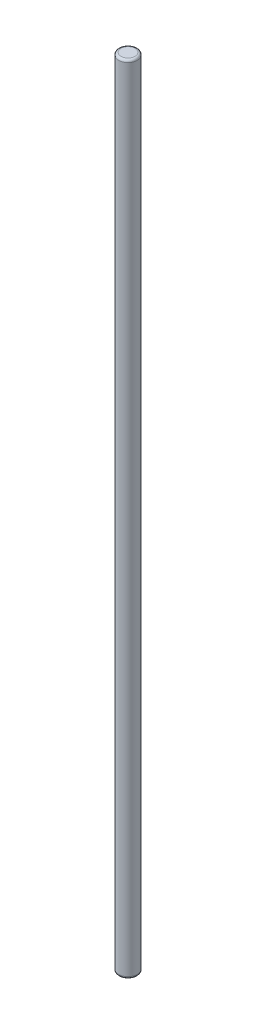
ISO-10303-21;
HEADER;
FILE_DESCRIPTION(('STEP AP214'),'2;1');
FILE_NAME('part.step','',(''),(''),'','','');
FILE_SCHEMA(('AUTOMOTIVE_DESIGN { 1 0 10303 214 1 1 1 1 }'));
ENDSEC;
DATA;
#1=APPLICATION_CONTEXT('core data for automotive mechanical design processes');
#2=APPLICATION_PROTOCOL_DEFINITION('international standard','automotive_design',2000,#1);
#3=PRODUCT_CONTEXT('',#1,'mechanical');
#4=PRODUCT('Part','Part','',(#3));
#5=PRODUCT_RELATED_PRODUCT_CATEGORY('part','',(#4));
#6=PRODUCT_DEFINITION_FORMATION('','',#4);
#7=PRODUCT_DEFINITION_CONTEXT('part definition',#1,'design');
#8=PRODUCT_DEFINITION('design','',#6,#7);
#9=PRODUCT_DEFINITION_SHAPE('','',#8);
#10=(LENGTH_UNIT() NAMED_UNIT(*) SI_UNIT(.MILLI.,.METRE.));
#11=(NAMED_UNIT(*) PLANE_ANGLE_UNIT() SI_UNIT($,.RADIAN.));
#12=(NAMED_UNIT(*) SI_UNIT($,.STERADIAN.) SOLID_ANGLE_UNIT());
#13=UNCERTAINTY_MEASURE_WITH_UNIT(LENGTH_MEASURE(1.E-05),#10,'distance_accuracy_value','');
#14=(GEOMETRIC_REPRESENTATION_CONTEXT(3) GLOBAL_UNCERTAINTY_ASSIGNED_CONTEXT((#13)) GLOBAL_UNIT_ASSIGNED_CONTEXT((#10,
#11,#12)) REPRESENTATION_CONTEXT('',''));
#15=CARTESIAN_POINT('',(0.,0.,0.));
#16=DIRECTION('',(0.,0.,1.));
#17=DIRECTION('',(1.,0.,0.));
#18=AXIS2_PLACEMENT_3D('',#15,#16,#17);
#19=CARTESIAN_POINT('',(0.,342.,0.));
#20=DIRECTION('',(0.,-1.,0.));
#21=DIRECTION('',(0.,0.,-1.));
#22=AXIS2_PLACEMENT_3D('',#19,#20,#21);
#23=CYLINDRICAL_SURFACE('',#22,4.);
#24=CARTESIAN_POINT('',(0.,1.,0.));
#25=DIRECTION('',(0.,1.,0.));
#26=DIRECTION('',(0.,0.,1.));
#27=AXIS2_PLACEMENT_3D('',#24,#25,#26);
#28=CIRCLE('',#27,4.);
#29=CARTESIAN_POINT('',(0.,1.,4.));
#30=VERTEX_POINT('',#29);
#31=EDGE_CURVE('E41',#30,#30,#28,.T.);
#32=ORIENTED_EDGE('',*,*,#31,.T.);
#33=EDGE_LOOP('',(#32));
#34=FACE_BOUND('',#33,.T.);
#35=CARTESIAN_POINT('',(0.,341.,0.));
#36=DIRECTION('',(0.,1.,0.));
#37=DIRECTION('',(0.,0.,1.));
#38=AXIS2_PLACEMENT_3D('',#35,#36,#37);
#39=CIRCLE('',#38,4.);
#40=CARTESIAN_POINT('',(0.,341.,4.));
#41=VERTEX_POINT('',#40);
#42=EDGE_CURVE('E45',#41,#41,#39,.F.);
#43=ORIENTED_EDGE('',*,*,#42,.T.);
#44=EDGE_LOOP('',(#43));
#45=FACE_BOUND('',#44,.T.);
#46=ADVANCED_FACE('F30',(#34,#45),#23,.T.);
#47=CARTESIAN_POINT('',(0.,342.,0.));
#48=DIRECTION('',(0.,1.,0.));
#49=DIRECTION('',(0.,0.,1.));
#50=AXIS2_PLACEMENT_3D('',#47,#48,#49);
#51=PLANE('',#50);
#52=CARTESIAN_POINT('',(0.,342.,0.));
#53=DIRECTION('',(0.,1.,0.));
#54=DIRECTION('',(0.,0.,1.));
#55=AXIS2_PLACEMENT_3D('',#52,#53,#54);
#56=CIRCLE('',#55,3.);
#57=CARTESIAN_POINT('',(0.,342.,3.));
#58=VERTEX_POINT('',#57);
#59=EDGE_CURVE('E10',#58,#58,#56,.T.);
#60=ORIENTED_EDGE('',*,*,#59,.T.);
#61=EDGE_LOOP('',(#60));
#62=FACE_BOUND('',#61,.T.);
#63=ADVANCED_FACE('F61',(#62),#51,.T.);
#64=CARTESIAN_POINT('',(0.,0.,0.));
#65=DIRECTION('',(0.,1.,0.));
#66=DIRECTION('',(0.,0.,1.));
#67=AXIS2_PLACEMENT_3D('',#64,#65,#66);
#68=PLANE('',#67);
#69=CARTESIAN_POINT('',(0.,0.,0.));
#70=DIRECTION('',(0.,1.,0.));
#71=DIRECTION('',(0.,0.,1.));
#72=AXIS2_PLACEMENT_3D('',#69,#70,#71);
#73=CIRCLE('',#72,3.);
#74=CARTESIAN_POINT('',(0.,0.,3.));
#75=VERTEX_POINT('',#74);
#76=EDGE_CURVE('E37',#75,#75,#73,.F.);
#77=ORIENTED_EDGE('',*,*,#76,.T.);
#78=EDGE_LOOP('',(#77));
#79=FACE_BOUND('',#78,.T.);
#80=ADVANCED_FACE('F58',(#79),#68,.F.);
#81=CARTESIAN_POINT('',(0.,1.,0.));
#82=DIRECTION('',(0.,1.,0.));
#83=DIRECTION('',(0.,0.,1.));
#84=AXIS2_PLACEMENT_3D('',#81,#82,#83);
#85=TOROIDAL_SURFACE('',#84,3.,1.);
#86=ORIENTED_EDGE('',*,*,#76,.F.);
#87=EDGE_LOOP('',(#86));
#88=FACE_BOUND('',#87,.T.);
#89=ORIENTED_EDGE('',*,*,#31,.F.);
#90=EDGE_LOOP('',(#89));
#91=FACE_BOUND('',#90,.T.);
#92=ADVANCED_FACE('F54',(#88,#91),#85,.T.);
#93=CARTESIAN_POINT('',(0.,341.,0.));
#94=DIRECTION('',(0.,1.,0.));
#95=DIRECTION('',(0.,0.,1.));
#96=AXIS2_PLACEMENT_3D('',#93,#94,#95);
#97=TOROIDAL_SURFACE('',#96,3.,1.);
#98=ORIENTED_EDGE('',*,*,#42,.F.);
#99=EDGE_LOOP('',(#98));
#100=FACE_BOUND('',#99,.T.);
#101=ORIENTED_EDGE('',*,*,#59,.F.);
#102=EDGE_LOOP('',(#101));
#103=FACE_BOUND('',#102,.T.);
#104=ADVANCED_FACE('F32',(#100,#103),#97,.T.);
#105=CLOSED_SHELL('',(#46,#63,#80,#92,#104));
#106=MANIFOLD_SOLID_BREP('B2',#105);
#107=ADVANCED_BREP_SHAPE_REPRESENTATION('',(#18,#106),#14);
#108=SHAPE_DEFINITION_REPRESENTATION(#9,#107);
ENDSEC;
END-ISO-10303-21;
